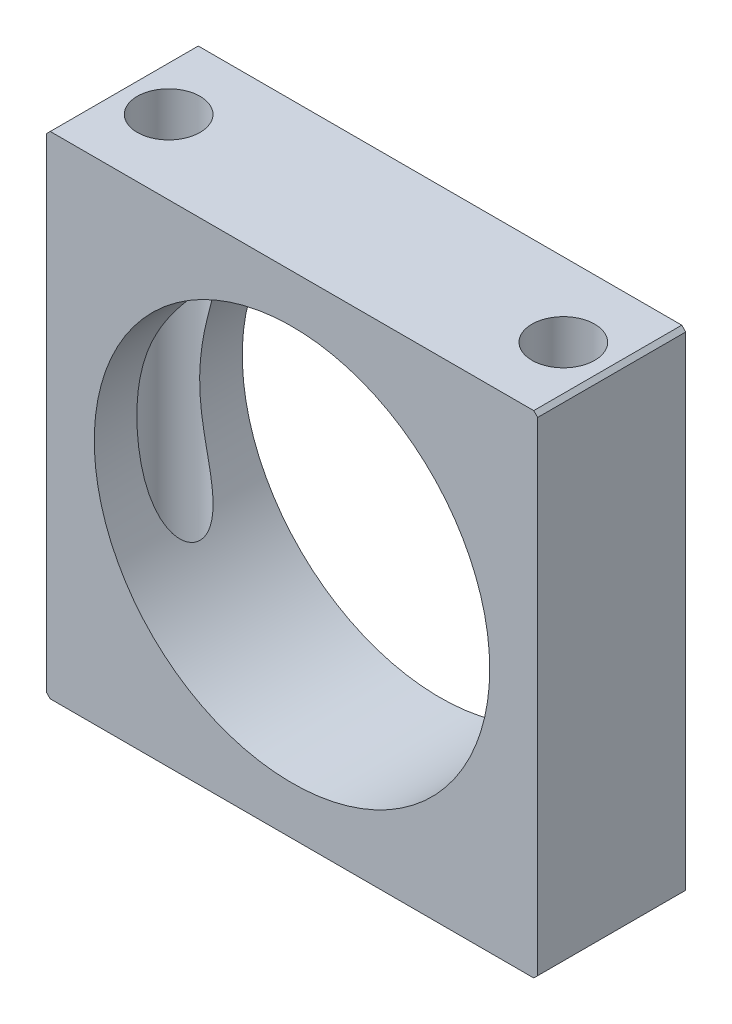
ISO-10303-21;
HEADER;
FILE_DESCRIPTION(('STEP AP214'),'2;1');
FILE_NAME('part.step','',(''),(''),'','','');
FILE_SCHEMA(('AUTOMOTIVE_DESIGN { 1 0 10303 214 1 1 1 1 }'));
ENDSEC;
DATA;
#1=APPLICATION_CONTEXT('core data for automotive mechanical design processes');
#2=APPLICATION_PROTOCOL_DEFINITION('international standard','automotive_design',2000,#1);
#3=PRODUCT_CONTEXT('',#1,'mechanical');
#4=PRODUCT('Part','Part','',(#3));
#5=PRODUCT_RELATED_PRODUCT_CATEGORY('part','',(#4));
#6=PRODUCT_DEFINITION_FORMATION('','',#4);
#7=PRODUCT_DEFINITION_CONTEXT('part definition',#1,'design');
#8=PRODUCT_DEFINITION('design','',#6,#7);
#9=PRODUCT_DEFINITION_SHAPE('','',#8);
#10=(LENGTH_UNIT() NAMED_UNIT(*) SI_UNIT(.MILLI.,.METRE.));
#11=(NAMED_UNIT(*) PLANE_ANGLE_UNIT() SI_UNIT($,.RADIAN.));
#12=(NAMED_UNIT(*) SI_UNIT($,.STERADIAN.) SOLID_ANGLE_UNIT());
#13=UNCERTAINTY_MEASURE_WITH_UNIT(LENGTH_MEASURE(1.E-05),#10,'distance_accuracy_value','');
#14=(GEOMETRIC_REPRESENTATION_CONTEXT(3) GLOBAL_UNCERTAINTY_ASSIGNED_CONTEXT((#13)) GLOBAL_UNIT_ASSIGNED_CONTEXT((#10,
#11,#12)) REPRESENTATION_CONTEXT('',''));
#15=CARTESIAN_POINT('',(0.,0.,0.));
#16=DIRECTION('',(0.,0.,1.));
#17=DIRECTION('',(1.,0.,0.));
#18=AXIS2_PLACEMENT_3D('',#15,#16,#17);
#19=CARTESIAN_POINT('',(0.,0.254000000000004,0.));
#20=DIRECTION('',(0.707106781186558,0.707106781186537,0.));
#21=DIRECTION('',(-0.707106781186537,0.707106781186558,0.));
#22=AXIS2_PLACEMENT_3D('',#19,#20,#21);
#23=PLANE('',#22);
#24=DIRECTION('',(0.,0.,1.));
#25=VECTOR('',#24,1.);
#26=CARTESIAN_POINT('',(0.253999999999997,0.,0.));
#27=LINE('',#26,#25);
#28=CARTESIAN_POINT('',(0.253999999999997,0.,9.525));
#29=VERTEX_POINT('',#28);
#30=CARTESIAN_POINT('',(0.253999999999997,0.,0.));
#31=VERTEX_POINT('',#30);
#32=EDGE_CURVE('E141',#29,#31,#27,.F.);
#33=ORIENTED_EDGE('',*,*,#32,.F.);
#34=DIRECTION('',(-0.707106781186537,0.707106781186558,0.));
#35=VECTOR('',#34,1.);
#36=CARTESIAN_POINT('',(0.,0.254000000000004,9.525));
#37=LINE('',#36,#35);
#38=CARTESIAN_POINT('',(0.,0.254000000000013,9.525));
#39=VERTEX_POINT('',#38);
#40=EDGE_CURVE('E99',#39,#29,#37,.F.);
#41=ORIENTED_EDGE('',*,*,#40,.F.);
#42=DIRECTION('',(0.,0.,1.));
#43=VECTOR('',#42,1.);
#44=CARTESIAN_POINT('',(0.,0.254000000000018,0.));
#45=LINE('',#44,#43);
#46=CARTESIAN_POINT('',(0.,0.254000000000013,0.));
#47=VERTEX_POINT('',#46);
#48=EDGE_CURVE('E98',#47,#39,#45,.T.);
#49=ORIENTED_EDGE('',*,*,#48,.F.);
#50=DIRECTION('',(0.707106781186527,-0.707106781186568,0.));
#51=VECTOR('',#50,1.);
#52=CARTESIAN_POINT('',(0.,0.254000000000015,0.));
#53=LINE('',#52,#51);
#54=EDGE_CURVE('E86',#47,#31,#53,.T.);
#55=ORIENTED_EDGE('',*,*,#54,.T.);
#56=EDGE_LOOP('',(#33,#41,#49,#55));
#57=FACE_BOUND('',#56,.T.);
#58=ADVANCED_FACE('F17',(#57),#23,.F.);
#59=CARTESIAN_POINT('',(31.369,0.,0.));
#60=DIRECTION('',(-0.707106781186547,0.707106781186548,0.));
#61=DIRECTION('',(-0.707106781186548,-0.707106781186547,0.));
#62=AXIS2_PLACEMENT_3D('',#59,#60,#61);
#63=PLANE('',#62);
#64=DIRECTION('',(0.,0.,-1.));
#65=VECTOR('',#64,1.);
#66=CARTESIAN_POINT('',(31.623,0.254000000000007,0.));
#67=LINE('',#66,#65);
#68=CARTESIAN_POINT('',(31.623,0.254000000000007,9.525));
#69=VERTEX_POINT('',#68);
#70=CARTESIAN_POINT('',(31.623,0.254000000000007,0.));
#71=VERTEX_POINT('',#70);
#72=EDGE_CURVE('E228',#69,#71,#67,.T.);
#73=ORIENTED_EDGE('',*,*,#72,.F.);
#74=DIRECTION('',(-0.707106781186548,-0.707106781186547,0.));
#75=VECTOR('',#74,1.);
#76=CARTESIAN_POINT('',(31.369,0.,9.525));
#77=LINE('',#76,#75);
#78=CARTESIAN_POINT('',(31.369,0.,9.525));
#79=VERTEX_POINT('',#78);
#80=EDGE_CURVE('E122',#79,#69,#77,.F.);
#81=ORIENTED_EDGE('',*,*,#80,.F.);
#82=DIRECTION('',(0.,0.,1.));
#83=VECTOR('',#82,1.);
#84=CARTESIAN_POINT('',(31.369,0.,0.));
#85=LINE('',#84,#83);
#86=CARTESIAN_POINT('',(31.369,0.,0.));
#87=VERTEX_POINT('',#86);
#88=EDGE_CURVE('E234',#87,#79,#85,.T.);
#89=ORIENTED_EDGE('',*,*,#88,.F.);
#90=DIRECTION('',(0.707106781186555,0.70710678118654,0.));
#91=VECTOR('',#90,1.);
#92=CARTESIAN_POINT('',(31.369,0.,0.));
#93=LINE('',#92,#91);
#94=EDGE_CURVE('E118',#87,#71,#93,.T.);
#95=ORIENTED_EDGE('',*,*,#94,.T.);
#96=EDGE_LOOP('',(#73,#81,#89,#95));
#97=FACE_BOUND('',#96,.T.);
#98=ADVANCED_FACE('F202',(#97),#63,.F.);
#99=CARTESIAN_POINT('',(28.5115,0.,4.7625));
#100=DIRECTION('',(0.,1.,0.));
#101=DIRECTION('',(0.,0.,1.));
#102=AXIS2_PLACEMENT_3D('',#99,#100,#101);
#103=CYLINDRICAL_SURFACE('',#102,2.0193);
#104=CARTESIAN_POINT('',(28.5115,0.,4.7625));
#105=DIRECTION('',(0.,1.,0.));
#106=DIRECTION('',(0.,0.,1.));
#107=AXIS2_PLACEMENT_3D('',#104,#105,#106);
#108=CIRCLE('',#107,2.0193);
#109=CARTESIAN_POINT('',(28.5115,0.,6.7818));
#110=VERTEX_POINT('',#109);
#111=EDGE_CURVE('E142',#110,#110,#108,.T.);
#112=ORIENTED_EDGE('',*,*,#111,.F.);
#113=EDGE_LOOP('',(#112));
#114=FACE_BOUND('',#113,.T.);
#115=CARTESIAN_POINT('',(28.5115,31.623,4.7625));
#116=DIRECTION('',(0.,1.,0.));
#117=DIRECTION('',(0.,0.,1.));
#118=AXIS2_PLACEMENT_3D('',#115,#116,#117);
#119=CIRCLE('',#118,2.0193);
#120=CARTESIAN_POINT('',(28.5115,31.623,6.7818));
#121=VERTEX_POINT('',#120);
#122=EDGE_CURVE('E134',#121,#121,#119,.F.);
#123=ORIENTED_EDGE('',*,*,#122,.F.);
#124=EDGE_LOOP('',(#123));
#125=FACE_BOUND('',#124,.T.);
#126=CARTESIAN_POINT('',(28.5115,16.6151200345937,2.74319999999999));
#127=CARTESIAN_POINT('',(28.5199653212104,16.4813430370531,2.74320270239754));
#128=CARTESIAN_POINT('',(28.5263158762675,16.3474399768635,2.74325062802151));
#129=CARTESIAN_POINT('',(28.5347827517717,16.0795244702182,2.74332907875549));
#130=CARTESIAN_POINT('',(28.5368999709793,15.945512053025,2.74335960755796));
#131=CARTESIAN_POINT('',(28.536900029006,15.6775559166359,2.74335990186155));
#132=CARTESIAN_POINT('',(28.5347850149188,15.5436121970708,2.7433296981734));
#133=CARTESIAN_POINT('',(28.526322201603,15.2756951322222,2.74325009105277));
#134=CARTESIAN_POINT('',(28.5199692103383,15.141721952357,2.74320066410047));
#135=CARTESIAN_POINT('',(28.5006511685445,14.836431967293,2.74319914930508));
#136=CARTESIAN_POINT('',(28.4863298494317,14.6651992426276,2.74327831319996));
#137=CARTESIAN_POINT('',(28.4507639873802,14.3234367237259,2.74403545692543));
#138=CARTESIAN_POINT('',(28.4295186182925,14.1529070158304,2.74471350822932));
#139=CARTESIAN_POINT('',(28.3801081029875,13.8126273188276,2.74732705653674));
#140=CARTESIAN_POINT('',(28.3519337391881,13.6428786777253,2.74926423423161));
#141=CARTESIAN_POINT('',(28.2887344511936,13.3047070137621,2.75527405754353));
#142=CARTESIAN_POINT('',(28.2537099752288,13.136283904916,2.75934656346674));
#143=CARTESIAN_POINT('',(28.1769646117507,12.8014278569892,2.77072658272209));
#144=CARTESIAN_POINT('',(28.1352572434751,12.6349916138971,2.77802761625686));
#145=CARTESIAN_POINT('',(28.0452092323457,12.3041426687441,2.7972347694156));
#146=CARTESIAN_POINT('',(27.9968673350173,12.1397303557952,2.80914176072264));
#147=CARTESIAN_POINT('',(27.8938736743695,11.8138519914117,2.83922573844674));
#148=CARTESIAN_POINT('',(27.8392357894094,11.6523803350742,2.85738910332814));
#149=CARTESIAN_POINT('',(27.7239329906724,11.3328225229877,2.90208533464119));
#150=CARTESIAN_POINT('',(27.6632714901554,11.1747345109502,2.92861347953247));
#151=CARTESIAN_POINT('',(27.5611040048811,10.9234282453846,2.98030993829984));
#152=CARTESIAN_POINT('',(27.5212840116499,10.8288109678863,3.00202178517003));
#153=CARTESIAN_POINT('',(27.4398400254016,10.6415939416869,3.050377247796));
#154=CARTESIAN_POINT('',(27.3982156979782,10.5489945717947,3.07702178076999));
#155=CARTESIAN_POINT('',(27.3135925758823,10.3665242495133,3.13607804401843));
#156=CARTESIAN_POINT('',(27.2705968024584,10.2766480494975,3.16847773059296));
#157=CARTESIAN_POINT('',(27.1836682807955,10.1001723616852,3.24013158612093));
#158=CARTESIAN_POINT('',(27.1397360141316,10.0135712503972,3.27938230329852));
#159=CARTESIAN_POINT('',(27.0428235727008,9.82766971518366,3.37466896265823));
#160=CARTESIAN_POINT('',(26.9897907548617,9.72929256687629,3.43249187626515));
#161=CARTESIAN_POINT('',(26.8854037535374,9.54125584218823,3.56236770191023));
#162=CARTESIAN_POINT('',(26.8340480633198,9.45158828961998,3.63440740742342));
#163=CARTESIAN_POINT('',(26.7500560588286,9.30852636786551,3.77281480481567));
#164=CARTESIAN_POINT('',(26.7161946798853,9.25199167963295,3.83515712711531));
#165=CARTESIAN_POINT('',(26.6530714006376,9.14818213783625,3.96922714840786));
#166=CARTESIAN_POINT('',(26.6238016963597,9.10089153867167,4.04093853501115));
#167=CARTESIAN_POINT('',(26.5782901191154,9.02817900877144,4.17589592751221));
#168=CARTESIAN_POINT('',(26.5606005197941,9.00022890095212,4.23727886934799));
#169=CARTESIAN_POINT('',(26.530700673956,8.9532698465948,4.36466399569805));
#170=CARTESIAN_POINT('',(26.5184864081335,8.93425434089277,4.43066275058029));
#171=CARTESIAN_POINT('',(26.5005967821325,8.90648006472163,4.56618929204118));
#172=CARTESIAN_POINT('',(26.4949681743239,8.89779462150321,4.63573869579954));
#173=CARTESIAN_POINT('',(26.4910334801698,8.89171771459723,4.77553213975767));
#174=CARTESIAN_POINT('',(26.4927247769399,8.89432221472707,4.84577592275619));
#175=CARTESIAN_POINT('',(26.502651666022,8.90967819577877,4.97686824520258));
#176=CARTESIAN_POINT('',(26.5101595332167,8.92130154238223,5.03791113034199));
#177=CARTESIAN_POINT('',(26.530196103875,8.95251309430616,5.15703949635868));
#178=CARTESIAN_POINT('',(26.5427265405966,8.97210404923387,5.21512394849178));
#179=CARTESIAN_POINT('',(26.57694270403,9.0260469027609,5.34654892578309));
#180=CARTESIAN_POINT('',(26.6002937427548,9.06315517287232,5.4183210162055));
#181=CARTESIAN_POINT('',(26.6522961811466,9.1470128956751,5.55384791767831));
#182=CARTESIAN_POINT('',(26.6809581643453,9.19378162124462,5.61758628550761));
#183=CARTESIAN_POINT('',(26.7567395024462,9.3195659189768,5.76671740611479));
#184=CARTESIAN_POINT('',(26.8059710354522,9.4030823048063,5.84720607711694));
#185=CARTESIAN_POINT('',(26.9076837203132,9.58084362320606,5.99264253749174));
#186=CARTESIAN_POINT('',(26.9601715653595,9.67511101114221,6.05755688646532));
#187=CARTESIAN_POINT('',(27.0598160898548,9.85994815666871,6.16786700297967));
#188=CARTESIAN_POINT('',(27.1069116055799,9.94974997418169,6.21463444727179));
#189=CARTESIAN_POINT('',(27.2004730258325,10.1336696801777,6.29963354602526));
#190=CARTESIAN_POINT('',(27.2469383894366,10.2277910059898,6.33785825533661));
#191=CARTESIAN_POINT('',(27.3385654476197,10.4194794845627,6.40721975903296));
#192=CARTESIAN_POINT('',(27.3837239184833,10.5170540240365,6.4383401472906));
#193=CARTESIAN_POINT('',(27.4721306897576,10.7147147019151,6.49455815108557));
#194=CARTESIAN_POINT('',(27.515379455027,10.8148002196941,6.51965723898987));
#195=CARTESIAN_POINT('',(27.6012065605999,11.020725490405,6.56566280556071));
#196=CARTESIAN_POINT('',(27.6437016974488,11.1266414750135,6.58638106462946));
#197=CARTESIAN_POINT('',(27.7260715508051,11.3402686968131,6.62333483550237));
#198=CARTESIAN_POINT('',(27.7659456990083,11.4479803170433,6.63956937753766));
#199=CARTESIAN_POINT('',(27.8814369784417,11.7735029371737,6.68275843258262));
#200=CARTESIAN_POINT('',(27.9528606496037,11.9935525731978,6.704167592949));
#201=CARTESIAN_POINT('',(28.0837726819043,12.4379435300594,6.73712794314051));
#202=CARTESIAN_POINT('',(28.1432536681567,12.6622874096153,6.74867305592211));
#203=CARTESIAN_POINT('',(28.2498686036745,13.1139815977602,6.76550530758962));
#204=CARTESIAN_POINT('',(28.2970089588245,13.3413302819456,6.77079569826742));
#205=CARTESIAN_POINT('',(28.3804709444385,13.8077062009253,6.77799711241717));
#206=CARTESIAN_POINT('',(28.4162676544204,14.0468290783341,6.77976014095217));
#207=CARTESIAN_POINT('',(28.4741517207061,14.5264596465523,6.7816630688818));
#208=CARTESIAN_POINT('',(28.4962550825482,14.7669653877115,6.78180486665852));
#209=CARTESIAN_POINT('',(28.5199653212104,15.1416569629469,6.78179729760245));
#210=CARTESIAN_POINT('',(28.5263158762675,15.2755600231365,6.78174937197848));
#211=CARTESIAN_POINT('',(28.5347827517717,15.5434755297818,6.7816709212445));
#212=CARTESIAN_POINT('',(28.5368999709793,15.677487946975,6.78164039244203));
#213=CARTESIAN_POINT('',(28.536900029006,15.9454440833641,6.78164009813845));
#214=CARTESIAN_POINT('',(28.5347850149188,16.0793878029292,6.7816703018266));
#215=CARTESIAN_POINT('',(28.526322201603,16.3473048677777,6.78174990894722));
#216=CARTESIAN_POINT('',(28.5199692103383,16.481278047643,6.78179933589952));
#217=CARTESIAN_POINT('',(28.5006511685445,16.786568032707,6.78180085069491));
#218=CARTESIAN_POINT('',(28.4863298494317,16.9578007573724,6.78172168680003));
#219=CARTESIAN_POINT('',(28.4507639873802,17.2995632762741,6.78096454307456));
#220=CARTESIAN_POINT('',(28.4295186182925,17.4700929841696,6.78028649177068));
#221=CARTESIAN_POINT('',(28.3801081029875,17.8103726811724,6.77767294346325));
#222=CARTESIAN_POINT('',(28.3519337391881,17.9801213222747,6.77573576576838));
#223=CARTESIAN_POINT('',(28.2887344511936,18.3182929862379,6.76972594245647));
#224=CARTESIAN_POINT('',(28.2537099752288,18.486716095084,6.76565343653326));
#225=CARTESIAN_POINT('',(28.1769646117507,18.8215721430108,6.75427341727791));
#226=CARTESIAN_POINT('',(28.1352572434751,18.9880083861029,6.74697238374313));
#227=CARTESIAN_POINT('',(28.0452092323457,19.3188573312559,6.7277652305844));
#228=CARTESIAN_POINT('',(27.9968673350173,19.4832696442048,6.71585823927735));
#229=CARTESIAN_POINT('',(27.8938736743695,19.8091480085883,6.68577426155325));
#230=CARTESIAN_POINT('',(27.8392357894094,19.9706196649258,6.66761089667185));
#231=CARTESIAN_POINT('',(27.7239329906724,20.2901774770123,6.6229146653588));
#232=CARTESIAN_POINT('',(27.6632714901554,20.4482654890498,6.59638652046752));
#233=CARTESIAN_POINT('',(27.5611040048811,20.6995717546154,6.54469006170015));
#234=CARTESIAN_POINT('',(27.5212840116499,20.7941890321136,6.52297821482996));
#235=CARTESIAN_POINT('',(27.4398400254016,20.9814060583131,6.47462275220399));
#236=CARTESIAN_POINT('',(27.3982156979782,21.0740054282053,6.44797821923));
#237=CARTESIAN_POINT('',(27.3135925758823,21.2564757504867,6.38892195598156));
#238=CARTESIAN_POINT('',(27.2705968024584,21.3463519505025,6.35652226940703));
#239=CARTESIAN_POINT('',(27.1836682807954,21.5228276383148,6.28486841387906));
#240=CARTESIAN_POINT('',(27.1397360141316,21.6094287496028,6.24561769670148));
#241=CARTESIAN_POINT('',(27.0428235727008,21.7953302848163,6.15033103734176));
#242=CARTESIAN_POINT('',(26.9897907548617,21.8937074331237,6.09250812373485));
#243=CARTESIAN_POINT('',(26.8854037535374,22.0817441578118,5.96263229808976));
#244=CARTESIAN_POINT('',(26.8340480633198,22.17141171038,5.89059259257657));
#245=CARTESIAN_POINT('',(26.7500560588286,22.3144736321345,5.75218519518432));
#246=CARTESIAN_POINT('',(26.7161946798853,22.371008320367,5.68984287288469));
#247=CARTESIAN_POINT('',(26.6530714006376,22.4748178621637,5.55577285159213));
#248=CARTESIAN_POINT('',(26.6238016963597,22.5221084613283,5.48406146498885));
#249=CARTESIAN_POINT('',(26.5782901191154,22.5948209912286,5.34910407248778));
#250=CARTESIAN_POINT('',(26.5606005197941,22.6227710990479,5.28772113065201));
#251=CARTESIAN_POINT('',(26.530700673956,22.6697301534052,5.16033600430194));
#252=CARTESIAN_POINT('',(26.5184864081335,22.6887456591072,5.0943372494197));
#253=CARTESIAN_POINT('',(26.5005967821325,22.7165199352784,4.95881070795881));
#254=CARTESIAN_POINT('',(26.4949681743239,22.7252053784968,4.88926130420045));
#255=CARTESIAN_POINT('',(26.4910334801698,22.7312822854028,4.74946786024232));
#256=CARTESIAN_POINT('',(26.4927247769399,22.7286777852729,4.6792240772438));
#257=CARTESIAN_POINT('',(26.502651666022,22.7133218042212,4.54813175479741));
#258=CARTESIAN_POINT('',(26.5101595332167,22.7016984576178,4.487088869658));
#259=CARTESIAN_POINT('',(26.530196103875,22.6704869056938,4.36796050364131));
#260=CARTESIAN_POINT('',(26.5427265405966,22.6508959507661,4.30987605150821));
#261=CARTESIAN_POINT('',(26.57694270403,22.5969530972391,4.1784510742169));
#262=CARTESIAN_POINT('',(26.6002937427548,22.5598448271277,4.10667898379449));
#263=CARTESIAN_POINT('',(26.6522961811466,22.4759871043249,3.97115208232168));
#264=CARTESIAN_POINT('',(26.6809581643453,22.4292183787554,3.90741371449238));
#265=CARTESIAN_POINT('',(26.7567395024462,22.3034340810232,3.7582825938852));
#266=CARTESIAN_POINT('',(26.8059710354522,22.2199176951937,3.67779392288305));
#267=CARTESIAN_POINT('',(26.9076837203132,22.0421563767939,3.53235746250825));
#268=CARTESIAN_POINT('',(26.9601715653595,21.9478889888578,3.46744311353467));
#269=CARTESIAN_POINT('',(27.0598160898548,21.7630518433313,3.35713299702032));
#270=CARTESIAN_POINT('',(27.1069116055799,21.6732500258183,3.3103655527282));
#271=CARTESIAN_POINT('',(27.2004730258325,21.4893303198223,3.22536645397473));
#272=CARTESIAN_POINT('',(27.2469383894366,21.3952089940102,3.18714174466338));
#273=CARTESIAN_POINT('',(27.3385654476197,21.2035205154373,3.11778024096703));
#274=CARTESIAN_POINT('',(27.3837239184833,21.1059459759635,3.08665985270939));
#275=CARTESIAN_POINT('',(27.4721306897576,20.9082852980849,3.03044184891442));
#276=CARTESIAN_POINT('',(27.515379455027,20.8081997803059,3.00534276101012));
#277=CARTESIAN_POINT('',(27.6012065605999,20.602274509595,2.95933719443928));
#278=CARTESIAN_POINT('',(27.6437016974488,20.4963585249865,2.93861893537053));
#279=CARTESIAN_POINT('',(27.7260715508051,20.2827313031868,2.90166516449762));
#280=CARTESIAN_POINT('',(27.7659456990083,20.1750196829567,2.88543062246233));
#281=CARTESIAN_POINT('',(27.8814369784417,19.8494970628263,2.84224156741738));
#282=CARTESIAN_POINT('',(27.9528606496037,19.6294474268022,2.82083240705099));
#283=CARTESIAN_POINT('',(28.0837726819043,19.1850564699406,2.78787205685948));
#284=CARTESIAN_POINT('',(28.1432536681567,18.9607125903847,2.77632694407788));
#285=CARTESIAN_POINT('',(28.2498686036745,18.5090184022398,2.75949469241037));
#286=CARTESIAN_POINT('',(28.2970089588245,18.2816697180544,2.75420430173257));
#287=CARTESIAN_POINT('',(28.3804709444385,17.8152937990747,2.74700288758283));
#288=CARTESIAN_POINT('',(28.4162676544204,17.5761709216659,2.74523985904783));
#289=CARTESIAN_POINT('',(28.4741517207061,17.0965403534477,2.74333693111819));
#290=CARTESIAN_POINT('',(28.4962550825482,16.8560346122885,2.74319513334148));
#291=CARTESIAN_POINT('',(28.5115,16.6151200345937,2.74319999999999));
#292=B_SPLINE_CURVE_WITH_KNOTS('',3,(#126,#127,#128,#129,#130,#131,#132,#133,#134,#135,#136,
#137,#138,#139,#140,#141,#142,#143,#144,#145,#146,#147,#148,#149,#150,#151,#152,#153,#154,#155,
#156,#157,#158,#159,#160,#161,#162,#163,#164,#165,#166,#167,#168,#169,#170,#171,#172,#173,#174,
#175,#176,#177,#178,#179,#180,#181,#182,#183,#184,#185,#186,#187,#188,#189,#190,#191,#192,#193,
#194,#195,#196,#197,#198,#199,#200,#201,#202,#203,#204,#205,#206,#207,#208,#209,#210,#211,#212,
#213,#214,#215,#216,#217,#218,#219,#220,#221,#222,#223,#224,#225,#226,#227,#228,#229,#230,#231,
#232,#233,#234,#235,#236,#237,#238,#239,#240,#241,#242,#243,#244,#245,#246,#247,#248,#249,#250,
#251,#252,#253,#254,#255,#256,#257,#258,#259,#260,#261,#262,#263,#264,#265,#266,#267,#268,#269,
#270,#271,#272,#273,#274,#275,#276,#277,#278,#279,#280,#281,#282,#283,#284,#285,#286,#287,#288,
#289,#290,#291),.UNSPECIFIED.,.T.,.F.,(4,2,2,2,2,2,2,2,2,2,2,2,2,2,2,2,2,2,2,2,2,2,2,2,2,2,2,2,
2,2,2,2,2,2,2,2,2,2,2,2,2,2,2,2,2,2,2,2,2,2,2,2,2,2,2,2,2,2,2,2,2,2,2,2,2,2,2,2,2,2,2,2,2,2,2,2,
2,2,2,2,2,2,4),(0.,0.40210354142174,0.804121705000044,1.20593596872273,1.6082434099645,
2.12358845973877,2.63899502087777,3.15509096730215,3.67115315477977,4.18618425078339,
4.70131286476891,5.21532694358039,5.72905140248845,6.04370670327851,6.35842057215425,
6.67248344208353,6.98638853111204,7.36306166959052,7.73938653512679,8.01071437980907,
8.28157596150202,8.4899567200692,8.69818426001524,8.90788123152498,9.11750324203387,
9.30444924962508,9.49145982676311,9.74236854129282,9.99378274603126,10.3696803912375,
10.7463780630539,11.0808945812981,11.4156820764171,11.7512350524477,12.0867058930888,
12.4345188051393,12.7824068857297,13.4786748948486,14.1753715521646,14.8717058416363,
15.5966898402826,16.3208248309917,16.7229283724135,17.1249465359918,17.5267607997144,
17.9290682409562,18.4444132907305,18.9598198518695,19.4759157982939,19.9919779857715,
20.5070090817751,21.0221376957606,21.5361517745721,22.0498762334802,22.3645315342702,
22.679245403146,22.9933082730753,23.3072133621038,23.6838865005822,24.0602113661185,
24.3315392108008,24.6024007924937,24.8107815510609,25.019009091007,25.2287060625167,
25.4383280730256,25.6252740806168,25.8122846577548,26.0631933722846,26.314607577023,
26.6905052222292,27.0672028940456,27.4017194122898,27.7365069074088,28.0720598834394,
28.4075307240805,28.7553436361311,29.1032317167214,29.7994997258403,30.4961963831563,
31.1925306726281,31.9175146712743,32.6416496619835),.UNSPECIFIED.);
#293=CARTESIAN_POINT('',(28.5115,16.6151200345937,2.74319999999999));
#294=VERTEX_POINT('',#293);
#295=EDGE_CURVE('E20',#294,#294,#292,.T.);
#296=ORIENTED_EDGE('',*,*,#295,.T.);
#297=EDGE_LOOP('',(#296));
#298=FACE_BOUND('',#297,.T.);
#299=ADVANCED_FACE('F170',(#114,#125,#298),#103,.F.);
#300=CARTESIAN_POINT('',(3.1115,0.,4.7625));
#301=DIRECTION('',(0.,1.,0.));
#302=DIRECTION('',(0.,0.,1.));
#303=AXIS2_PLACEMENT_3D('',#300,#301,#302);
#304=CYLINDRICAL_SURFACE('',#303,2.0193);
#305=CARTESIAN_POINT('',(3.1115,16.6151200345936,6.7818));
#306=CARTESIAN_POINT('',(3.10303467878958,16.481343037053,6.78179729760245));
#307=CARTESIAN_POINT('',(3.09668412373254,16.3474399768634,6.78174937197848));
#308=CARTESIAN_POINT('',(3.08821724822826,16.0795244702181,6.7816709212445));
#309=CARTESIAN_POINT('',(3.08610002902073,15.945512053025,6.78164039244204));
#310=CARTESIAN_POINT('',(3.08609997099397,15.677555916636,6.78164009813845));
#311=CARTESIAN_POINT('',(3.08821498508121,15.5436121970708,6.7816703018266));
#312=CARTESIAN_POINT('',(3.09667779839696,15.2756951322223,6.78174990894723));
#313=CARTESIAN_POINT('',(3.10303078966174,15.1417219523571,6.78179933589952));
#314=CARTESIAN_POINT('',(3.12234883145549,14.8364319672931,6.78180085069491));
#315=CARTESIAN_POINT('',(3.13667015056824,14.6651992426277,6.78172168680004));
#316=CARTESIAN_POINT('',(3.17223601261975,14.323436723726,6.78096454307456));
#317=CARTESIAN_POINT('',(3.1934813817075,14.1529070158306,6.78028649177068));
#318=CARTESIAN_POINT('',(3.24289189701244,13.8126273188277,6.77767294346325));
#319=CARTESIAN_POINT('',(3.27106626081184,13.6428786777255,6.77573576576838));
#320=CARTESIAN_POINT('',(3.33426554880642,13.3047070137623,6.76972594245647));
#321=CARTESIAN_POINT('',(3.36929002477115,13.1362839049161,6.76565343653326));
#322=CARTESIAN_POINT('',(3.44603538824928,12.8014278569893,6.75427341727791));
#323=CARTESIAN_POINT('',(3.48774275652484,12.6349916138972,6.74697238374314));
#324=CARTESIAN_POINT('',(3.57779076765423,12.3041426687442,6.7277652305844));
#325=CARTESIAN_POINT('',(3.6261326649827,12.1397303557953,6.71585823927736));
#326=CARTESIAN_POINT('',(3.72912632563049,11.8138519914118,6.68577426155326));
#327=CARTESIAN_POINT('',(3.78376421059059,11.6523803350743,6.66761089667187));
#328=CARTESIAN_POINT('',(3.89906700932753,11.3328225229879,6.62291466535881));
#329=CARTESIAN_POINT('',(3.95972850984452,11.1747345109503,6.59638652046754));
#330=CARTESIAN_POINT('',(4.0618959951189,10.9234282453847,6.54469006170017));
#331=CARTESIAN_POINT('',(4.1017159883501,10.8288109678864,6.52297821482998));
#332=CARTESIAN_POINT('',(4.18315997459838,10.6415939416869,6.47462275220401));
#333=CARTESIAN_POINT('',(4.22478430202177,10.5489945717947,6.44797821923002));
#334=CARTESIAN_POINT('',(4.30940742411767,10.3665242495133,6.38892195598158));
#335=CARTESIAN_POINT('',(4.35240319754159,10.2766480494976,6.35652226940705));
#336=CARTESIAN_POINT('',(4.43933171920453,10.1001723616853,6.28486841387908));
#337=CARTESIAN_POINT('',(4.48326398586839,10.0135712503973,6.24561769670149));
#338=CARTESIAN_POINT('',(4.58017642729918,9.82766971518369,6.15033103734177));
#339=CARTESIAN_POINT('',(4.6332092451383,9.72929256687632,6.09250812373486));
#340=CARTESIAN_POINT('',(4.7375962464626,9.54125584218826,5.96263229808978));
#341=CARTESIAN_POINT('',(4.78895193668016,9.45158828962002,5.89059259257659));
#342=CARTESIAN_POINT('',(4.87294394117134,9.30852636786555,5.75218519518435));
#343=CARTESIAN_POINT('',(4.90680532011464,9.25199167963299,5.68984287288471));
#344=CARTESIAN_POINT('',(4.96992859936243,9.14818213783628,5.55577285159216));
#345=CARTESIAN_POINT('',(4.99919830364024,9.1008915386717,5.48406146498887));
#346=CARTESIAN_POINT('',(5.04470988088462,9.02817900877146,5.3491040724878));
#347=CARTESIAN_POINT('',(5.06239948020592,9.00022890095214,5.28772113065203));
#348=CARTESIAN_POINT('',(5.09229932604396,8.95326984659481,5.16033600430196));
#349=CARTESIAN_POINT('',(5.10451359186649,8.93425434089279,5.09433724941972));
#350=CARTESIAN_POINT('',(5.12240321786751,8.90648006472165,4.95881070795883));
#351=CARTESIAN_POINT('',(5.12803182567607,8.89779462150323,4.88926130420047));
#352=CARTESIAN_POINT('',(5.13196651983023,8.89171771459725,4.74946786024234));
#353=CARTESIAN_POINT('',(5.13027522306011,8.89432221472708,4.67922407724382));
#354=CARTESIAN_POINT('',(5.12034833397796,8.90967819577878,4.54813175479743));
#355=CARTESIAN_POINT('',(5.11284046678328,8.92130154238224,4.48708886965802));
#356=CARTESIAN_POINT('',(5.09280389612503,8.95251309430617,4.36796050364133));
#357=CARTESIAN_POINT('',(5.08027345940335,8.97210404923388,4.30987605150823));
#358=CARTESIAN_POINT('',(5.04605729597002,9.02604690276091,4.17845107421692));
#359=CARTESIAN_POINT('',(5.02270625724518,9.06315517287233,4.10667898379451));
#360=CARTESIAN_POINT('',(4.97070381885335,9.1470128956751,3.9711520823217));
#361=CARTESIAN_POINT('',(4.94204183565467,9.19378162124462,3.9074137144924));
#362=CARTESIAN_POINT('',(4.86626049755376,9.3195659189768,3.75828259388523));
#363=CARTESIAN_POINT('',(4.81702896454783,9.4030823048063,3.67779392288308));
#364=CARTESIAN_POINT('',(4.71531627968681,9.58084362320606,3.53235746250828));
#365=CARTESIAN_POINT('',(4.66282843464055,9.6751110111422,3.4674431135347));
#366=CARTESIAN_POINT('',(4.56318391014516,9.8599481566687,3.35713299702035));
#367=CARTESIAN_POINT('',(4.5160883944201,9.94974997418167,3.31036555272823));
#368=CARTESIAN_POINT('',(4.42252697416751,10.1336696801777,3.22536645397475));
#369=CARTESIAN_POINT('',(4.37606161056346,10.2277910059898,3.1871417446634));
#370=CARTESIAN_POINT('',(4.28443455238028,10.4194794845627,3.11778024096705));
#371=CARTESIAN_POINT('',(4.23927608151668,10.5170540240364,3.08665985270942));
#372=CARTESIAN_POINT('',(4.15086931024237,10.7147147019151,3.03044184891444));
#373=CARTESIAN_POINT('',(4.10762054497305,10.8148002196941,3.00534276101014));
#374=CARTESIAN_POINT('',(4.02179343940012,11.020725490405,2.9593371944393));
#375=CARTESIAN_POINT('',(3.97929830255117,11.1266414750134,2.93861893537055));
#376=CARTESIAN_POINT('',(3.89692844919489,11.3402686968131,2.90166516449764));
#377=CARTESIAN_POINT('',(3.85705430099169,11.4479803170432,2.88543062246235));
#378=CARTESIAN_POINT('',(3.74156302155836,11.7735029371737,2.84224156741739));
#379=CARTESIAN_POINT('',(3.67013935039628,11.9935525731977,2.820832407051));
#380=CARTESIAN_POINT('',(3.53922731809574,12.4379435300593,2.78787205685949));
#381=CARTESIAN_POINT('',(3.47974633184333,12.6622874096152,2.77632694407789));
#382=CARTESIAN_POINT('',(3.37313139632555,13.1139815977601,2.75949469241038));
#383=CARTESIAN_POINT('',(3.32599104117548,13.3413302819455,2.75420430173258));
#384=CARTESIAN_POINT('',(3.2425290555615,13.8077062009252,2.74700288758283));
#385=CARTESIAN_POINT('',(3.20673234557958,14.046829078334,2.74523985904783));
#386=CARTESIAN_POINT('',(3.14884827929394,14.5264596465523,2.7433369311182));
#387=CARTESIAN_POINT('',(3.12674491745181,14.7669653877116,2.74319513334148));
#388=CARTESIAN_POINT('',(3.10303467878959,15.141656962947,2.74320270239755));
#389=CARTESIAN_POINT('',(3.09668412373254,15.2755600231366,2.74325062802152));
#390=CARTESIAN_POINT('',(3.08821724822826,15.5434755297819,2.7433290787555));
#391=CARTESIAN_POINT('',(3.08610002902073,15.677487946975,2.74335960755796));
#392=CARTESIAN_POINT('',(3.08609997099397,15.945444083364,2.74335990186155));
#393=CARTESIAN_POINT('',(3.08821498508121,16.0793878029292,2.7433296981734));
#394=CARTESIAN_POINT('',(3.09667779839696,16.3473048677777,2.74325009105277));
#395=CARTESIAN_POINT('',(3.10303078966174,16.4812780476429,2.74320066410048));
#396=CARTESIAN_POINT('',(3.12234883145549,16.7865680327069,2.74319914930509));
#397=CARTESIAN_POINT('',(3.13667015056824,16.9578007573723,2.74327831319997));
#398=CARTESIAN_POINT('',(3.17223601261975,17.299563276274,2.74403545692544));
#399=CARTESIAN_POINT('',(3.1934813817075,17.4700929841694,2.74471350822932));
#400=CARTESIAN_POINT('',(3.24289189701244,17.8103726811723,2.74732705653675));
#401=CARTESIAN_POINT('',(3.27106626081184,17.9801213222745,2.74926423423162));
#402=CARTESIAN_POINT('',(3.33426554880642,18.3182929862377,2.75527405754353));
#403=CARTESIAN_POINT('',(3.36929002477116,18.4867160950839,2.75934656346674));
#404=CARTESIAN_POINT('',(3.44603538824928,18.8215721430107,2.77072658272209));
#405=CARTESIAN_POINT('',(3.48774275652484,18.9880083861028,2.77802761625686));
#406=CARTESIAN_POINT('',(3.57779076765423,19.3188573312558,2.7972347694156));
#407=CARTESIAN_POINT('',(3.6261326649827,19.4832696442047,2.80914176072264));
#408=CARTESIAN_POINT('',(3.72912632563049,19.8091480085882,2.83922573844674));
#409=CARTESIAN_POINT('',(3.78376421059059,19.9706196649257,2.85738910332813));
#410=CARTESIAN_POINT('',(3.89906700932753,20.2901774770121,2.90208533464118));
#411=CARTESIAN_POINT('',(3.95972850984451,20.4482654890497,2.92861347953246));
#412=CARTESIAN_POINT('',(4.06189599511889,20.6995717546153,2.98030993829983));
#413=CARTESIAN_POINT('',(4.1017159883501,20.7941890321135,3.00202178517002));
#414=CARTESIAN_POINT('',(4.18315997459838,20.9814060583131,3.05037724779599));
#415=CARTESIAN_POINT('',(4.22478430202177,21.0740054282053,3.07702178076998));
#416=CARTESIAN_POINT('',(4.30940742411767,21.2564757504867,3.13607804401842));
#417=CARTESIAN_POINT('',(4.35240319754159,21.3463519505024,3.16847773059295));
#418=CARTESIAN_POINT('',(4.43933171920453,21.5228276383147,3.24013158612092));
#419=CARTESIAN_POINT('',(4.48326398586839,21.6094287496027,3.27938230329851));
#420=CARTESIAN_POINT('',(4.58017642729917,21.7953302848163,3.37466896265823));
#421=CARTESIAN_POINT('',(4.6332092451383,21.8937074331237,3.43249187626514));
#422=CARTESIAN_POINT('',(4.7375962464626,22.0817441578117,3.56236770191022));
#423=CARTESIAN_POINT('',(4.78895193668016,22.17141171038,3.63440740742341));
#424=CARTESIAN_POINT('',(4.87294394117134,22.3144736321345,3.77281480481565));
#425=CARTESIAN_POINT('',(4.90680532011464,22.371008320367,3.83515712711529));
#426=CARTESIAN_POINT('',(4.96992859936243,22.4748178621637,3.96922714840784));
#427=CARTESIAN_POINT('',(4.99919830364024,22.5221084613283,4.04093853501113));
#428=CARTESIAN_POINT('',(5.04470988088462,22.5948209912285,4.1758959275122));
#429=CARTESIAN_POINT('',(5.06239948020592,22.6227710990479,4.23727886934797));
#430=CARTESIAN_POINT('',(5.09229932604396,22.6697301534052,4.36466399569803));
#431=CARTESIAN_POINT('',(5.10451359186649,22.6887456591072,4.43066275058027));
#432=CARTESIAN_POINT('',(5.12240321786751,22.7165199352784,4.56618929204116));
#433=CARTESIAN_POINT('',(5.12803182567607,22.7252053784968,4.63573869579952));
#434=CARTESIAN_POINT('',(5.13196651983022,22.7312822854027,4.77553213975766));
#435=CARTESIAN_POINT('',(5.13027522306011,22.7286777852729,4.84577592275618));
#436=CARTESIAN_POINT('',(5.12034833397796,22.7133218042212,4.97686824520257));
#437=CARTESIAN_POINT('',(5.11284046678328,22.7016984576178,5.03791113034198));
#438=CARTESIAN_POINT('',(5.09280389612503,22.6704869056938,5.15703949635867));
#439=CARTESIAN_POINT('',(5.08027345940335,22.6508959507661,5.21512394849176));
#440=CARTESIAN_POINT('',(5.04605729597002,22.5969530972391,5.34654892578307));
#441=CARTESIAN_POINT('',(5.02270625724518,22.5598448271277,5.41832101620549));
#442=CARTESIAN_POINT('',(4.97070381885335,22.4759871043249,5.55384791767829));
#443=CARTESIAN_POINT('',(4.94204183565467,22.4292183787554,5.61758628550759));
#444=CARTESIAN_POINT('',(4.86626049755376,22.3034340810232,5.76671740611477));
#445=CARTESIAN_POINT('',(4.81702896454783,22.2199176951937,5.84720607711692));
#446=CARTESIAN_POINT('',(4.71531627968682,22.042156376794,5.99264253749171));
#447=CARTESIAN_POINT('',(4.66282843464056,21.9478889888578,6.05755688646529));
#448=CARTESIAN_POINT('',(4.56318391014517,21.7630518433313,6.16786700297965));
#449=CARTESIAN_POINT('',(4.5160883944201,21.6732500258183,6.21463444727176));
#450=CARTESIAN_POINT('',(4.42252697416752,21.4893303198223,6.29963354602524));
#451=CARTESIAN_POINT('',(4.37606161056347,21.3952089940102,6.33785825533659));
#452=CARTESIAN_POINT('',(4.28443455238029,21.2035205154373,6.40721975903294));
#453=CARTESIAN_POINT('',(4.23927608151669,21.1059459759636,6.43834014729058));
#454=CARTESIAN_POINT('',(4.15086931024238,20.9082852980849,6.49455815108555));
#455=CARTESIAN_POINT('',(4.10762054497306,20.8081997803059,6.51965723898986));
#456=CARTESIAN_POINT('',(4.02179343940013,20.6022745095951,6.5656628055607));
#457=CARTESIAN_POINT('',(3.97929830255118,20.4963585249866,6.58638106462944));
#458=CARTESIAN_POINT('',(3.8969284491949,20.2827313031869,6.62333483550236));
#459=CARTESIAN_POINT('',(3.85705430099171,20.1750196829568,6.63956937753765));
#460=CARTESIAN_POINT('',(3.74156302155837,19.8494970628264,6.68275843258261));
#461=CARTESIAN_POINT('',(3.67013935039629,19.6294474268023,6.70416759294899));
#462=CARTESIAN_POINT('',(3.53922731809575,19.1850564699407,6.73712794314051));
#463=CARTESIAN_POINT('',(3.47974633184335,18.9607125903848,6.74867305592211));
#464=CARTESIAN_POINT('',(3.37313139632556,18.5090184022399,6.76550530758962));
#465=CARTESIAN_POINT('',(3.32599104117549,18.2816697180546,6.77079569826742));
#466=CARTESIAN_POINT('',(3.24252905556151,17.8152937990748,6.77799711241717));
#467=CARTESIAN_POINT('',(3.20673234557958,17.576170921666,6.77976014095217));
#468=CARTESIAN_POINT('',(3.14884827929394,17.0965403534477,6.7816630688818));
#469=CARTESIAN_POINT('',(3.12674491745181,16.8560346122884,6.78180486665852));
#470=CARTESIAN_POINT('',(3.1115,16.6151200345936,6.7818));
#471=B_SPLINE_CURVE_WITH_KNOTS('',3,(#305,#306,#307,#308,#309,#310,#311,#312,#313,#314,#315,
#316,#317,#318,#319,#320,#321,#322,#323,#324,#325,#326,#327,#328,#329,#330,#331,#332,#333,#334,
#335,#336,#337,#338,#339,#340,#341,#342,#343,#344,#345,#346,#347,#348,#349,#350,#351,#352,#353,
#354,#355,#356,#357,#358,#359,#360,#361,#362,#363,#364,#365,#366,#367,#368,#369,#370,#371,#372,
#373,#374,#375,#376,#377,#378,#379,#380,#381,#382,#383,#384,#385,#386,#387,#388,#389,#390,#391,
#392,#393,#394,#395,#396,#397,#398,#399,#400,#401,#402,#403,#404,#405,#406,#407,#408,#409,#410,
#411,#412,#413,#414,#415,#416,#417,#418,#419,#420,#421,#422,#423,#424,#425,#426,#427,#428,#429,
#430,#431,#432,#433,#434,#435,#436,#437,#438,#439,#440,#441,#442,#443,#444,#445,#446,#447,#448,
#449,#450,#451,#452,#453,#454,#455,#456,#457,#458,#459,#460,#461,#462,#463,#464,#465,#466,#467,
#468,#469,#470),.UNSPECIFIED.,.T.,.F.,(4,2,2,2,2,2,2,2,2,2,2,2,2,2,2,2,2,2,2,2,2,2,2,2,2,2,2,2,
2,2,2,2,2,2,2,2,2,2,2,2,2,2,2,2,2,2,2,2,2,2,2,2,2,2,2,2,2,2,2,2,2,2,2,2,2,2,2,2,2,2,2,2,2,2,2,2,
2,2,2,2,2,2,4),(0.,0.402103541421681,0.804121704999922,1.20593596872255,1.60824340996427,
2.12358845973853,2.63899502087753,3.15509096730192,3.67115315477953,4.18618425078316,
4.70131286476868,5.21532694358015,5.72905140248821,6.04370670327829,6.35842057215406,
6.67248344208336,6.98638853111189,7.36306166959035,7.73938653512661,8.0107143798089,
8.28157596150186,8.48995672006905,8.69818426001509,8.90788123152483,9.11750324203372,
9.30444924962494,9.49145982676296,9.74236854129267,9.9937827460311,10.3696803912373,
10.7463780630537,11.0808945812979,11.4156820764169,11.7512350524475,12.0867058930886,
12.4345188051391,12.7824068857295,13.4786748948484,14.1753715521643,14.8717058416361,
15.5966898402824,16.3208248309917,16.7229283724134,17.1249465359916,17.5267607997142,
17.9290682409559,18.4444132907302,18.9598198518692,19.4759157982936,19.9919779857712,
20.5070090817748,21.0221376957603,21.5361517745718,22.0498762334799,22.36453153427,
22.6792454031457,22.993308273075,23.3072133621036,23.683886500582,24.0602113661183,
24.3315392108006,24.6024007924935,24.8107815510607,25.0190090910068,25.2287060625165,
25.4383280730254,25.6252740806166,25.8122846577546,26.0631933722843,26.3146075770228,
26.690505222229,27.0672028940454,27.4017194122895,27.7365069074086,28.0720598834391,
28.4075307240802,28.7553436361307,29.1032317167211,29.79949972584,30.4961963831559,
31.1925306726277,31.9175146712741,32.6416496619834),.UNSPECIFIED.);
#472=CARTESIAN_POINT('',(3.1115,16.6151200345936,6.7818));
#473=VERTEX_POINT('',#472);
#474=EDGE_CURVE('E110',#473,#473,#471,.T.);
#475=ORIENTED_EDGE('',*,*,#474,.T.);
#476=EDGE_LOOP('',(#475));
#477=FACE_BOUND('',#476,.T.);
#478=CARTESIAN_POINT('',(3.1115,31.623,4.7625));
#479=DIRECTION('',(0.,1.,0.));
#480=DIRECTION('',(0.,0.,1.));
#481=AXIS2_PLACEMENT_3D('',#478,#479,#480);
#482=CIRCLE('',#481,2.0193);
#483=CARTESIAN_POINT('',(3.1115,31.623,6.7818));
#484=VERTEX_POINT('',#483);
#485=EDGE_CURVE('E130',#484,#484,#482,.F.);
#486=ORIENTED_EDGE('',*,*,#485,.F.);
#487=EDGE_LOOP('',(#486));
#488=FACE_BOUND('',#487,.T.);
#489=CARTESIAN_POINT('',(3.1115,0.,4.7625));
#490=DIRECTION('',(0.,1.,0.));
#491=DIRECTION('',(0.,0.,1.));
#492=AXIS2_PLACEMENT_3D('',#489,#490,#491);
#493=CIRCLE('',#492,2.0193);
#494=CARTESIAN_POINT('',(3.1115,0.,6.7818));
#495=VERTEX_POINT('',#494);
#496=EDGE_CURVE('E138',#495,#495,#493,.T.);
#497=ORIENTED_EDGE('',*,*,#496,.F.);
#498=EDGE_LOOP('',(#497));
#499=FACE_BOUND('',#498,.T.);
#500=ADVANCED_FACE('F148',(#477,#488,#499),#304,.F.);
#501=CARTESIAN_POINT('',(31.623,31.369,0.));
#502=DIRECTION('',(-0.707106781186548,-0.707106781186548,0.));
#503=DIRECTION('',(0.707106781186548,-0.707106781186548,0.));
#504=AXIS2_PLACEMENT_3D('',#501,#502,#503);
#505=PLANE('',#504);
#506=DIRECTION('',(0.,0.,1.));
#507=VECTOR('',#506,1.);
#508=CARTESIAN_POINT('',(31.369,31.623,0.));
#509=LINE('',#508,#507);
#510=CARTESIAN_POINT('',(31.369,31.623,9.525));
#511=VERTEX_POINT('',#510);
#512=CARTESIAN_POINT('',(31.369,31.623,0.));
#513=VERTEX_POINT('',#512);
#514=EDGE_CURVE('E133',#511,#513,#509,.F.);
#515=ORIENTED_EDGE('',*,*,#514,.F.);
#516=DIRECTION('',(0.707106781186548,-0.707106781186548,0.));
#517=VECTOR('',#516,1.);
#518=CARTESIAN_POINT('',(31.623,31.369,9.525));
#519=LINE('',#518,#517);
#520=CARTESIAN_POINT('',(31.623,31.369,9.525));
#521=VERTEX_POINT('',#520);
#522=EDGE_CURVE('E120',#521,#511,#519,.F.);
#523=ORIENTED_EDGE('',*,*,#522,.F.);
#524=DIRECTION('',(0.,0.,-1.));
#525=VECTOR('',#524,1.);
#526=CARTESIAN_POINT('',(31.623,31.369,0.));
#527=LINE('',#526,#525);
#528=CARTESIAN_POINT('',(31.623,31.369,0.));
#529=VERTEX_POINT('',#528);
#530=EDGE_CURVE('E137',#529,#521,#527,.F.);
#531=ORIENTED_EDGE('',*,*,#530,.F.);
#532=DIRECTION('',(-0.707106781186538,0.707106781186557,0.));
#533=VECTOR('',#532,1.);
#534=CARTESIAN_POINT('',(31.623,31.369,0.));
#535=LINE('',#534,#533);
#536=EDGE_CURVE('E95',#529,#513,#535,.T.);
#537=ORIENTED_EDGE('',*,*,#536,.T.);
#538=EDGE_LOOP('',(#515,#523,#531,#537));
#539=FACE_BOUND('',#538,.T.);
#540=ADVANCED_FACE('F163',(#539),#505,.F.);
#541=CARTESIAN_POINT('',(0.,0.,0.));
#542=DIRECTION('',(0.,0.,1.));
#543=DIRECTION('',(1.,0.,0.));
#544=AXIS2_PLACEMENT_3D('',#541,#542,#543);
#545=PLANE('',#544);
#546=ORIENTED_EDGE('',*,*,#54,.F.);
#547=DIRECTION('',(0.,-1.,0.));
#548=VECTOR('',#547,1.);
#549=CARTESIAN_POINT('',(0.,31.623,0.));
#550=LINE('',#549,#548);
#551=CARTESIAN_POINT('',(0.,31.369,0.));
#552=VERTEX_POINT('',#551);
#553=EDGE_CURVE('E83',#552,#47,#550,.T.);
#554=ORIENTED_EDGE('',*,*,#553,.F.);
#555=DIRECTION('',(0.707106781186549,0.707106781186546,0.));
#556=VECTOR('',#555,1.);
#557=CARTESIAN_POINT('',(0.253999999999997,31.623,0.));
#558=LINE('',#557,#556);
#559=CARTESIAN_POINT('',(0.253999999999993,31.623,0.));
#560=VERTEX_POINT('',#559);
#561=EDGE_CURVE('E114',#552,#560,#558,.T.);
#562=ORIENTED_EDGE('',*,*,#561,.T.);
#563=DIRECTION('',(1.,0.,0.));
#564=VECTOR('',#563,1.);
#565=CARTESIAN_POINT('',(31.623,31.623,0.));
#566=LINE('',#565,#564);
#567=EDGE_CURVE('E246',#513,#560,#566,.F.);
#568=ORIENTED_EDGE('',*,*,#567,.F.);
#569=ORIENTED_EDGE('',*,*,#536,.F.);
#570=DIRECTION('',(0.,1.,0.));
#571=VECTOR('',#570,1.);
#572=CARTESIAN_POINT('',(31.623,0.,0.));
#573=LINE('',#572,#571);
#574=EDGE_CURVE('E233',#71,#529,#573,.T.);
#575=ORIENTED_EDGE('',*,*,#574,.F.);
#576=ORIENTED_EDGE('',*,*,#94,.F.);
#577=DIRECTION('',(1.,0.,0.));
#578=VECTOR('',#577,1.);
#579=CARTESIAN_POINT('',(0.,0.,0.));
#580=LINE('',#579,#578);
#581=EDGE_CURVE('E91',#31,#87,#580,.T.);
#582=ORIENTED_EDGE('',*,*,#581,.F.);
#583=EDGE_LOOP('',(#546,#554,#562,#568,#569,#575,#576,#582));
#584=FACE_BOUND('',#583,.T.);
#585=CARTESIAN_POINT('',(15.8115,15.8115,0.));
#586=DIRECTION('',(0.,0.,1.));
#587=DIRECTION('',(1.,0.,0.));
#588=AXIS2_PLACEMENT_3D('',#585,#586,#587);
#589=CIRCLE('',#588,12.7254);
#590=CARTESIAN_POINT('',(28.5369,15.8115,0.));
#591=VERTEX_POINT('',#590);
#592=EDGE_CURVE('E107',#591,#591,#589,.T.);
#593=ORIENTED_EDGE('',*,*,#592,.T.);
#594=EDGE_LOOP('',(#593));
#595=FACE_BOUND('',#594,.T.);
#596=ADVANCED_FACE('F88',(#584,#595),#545,.F.);
#597=CARTESIAN_POINT('',(0.253999999999997,31.623,0.));
#598=DIRECTION('',(0.707106781186546,-0.707106781186549,0.));
#599=DIRECTION('',(0.707106781186549,0.707106781186546,0.));
#600=AXIS2_PLACEMENT_3D('',#597,#598,#599);
#601=PLANE('',#600);
#602=DIRECTION('',(0.,0.,1.));
#603=VECTOR('',#602,1.);
#604=CARTESIAN_POINT('',(0.,31.369,0.));
#605=LINE('',#604,#603);
#606=CARTESIAN_POINT('',(0.,31.369,9.525));
#607=VERTEX_POINT('',#606);
#608=EDGE_CURVE('E103',#607,#552,#605,.F.);
#609=ORIENTED_EDGE('',*,*,#608,.F.);
#610=DIRECTION('',(0.707106781186549,0.707106781186546,0.));
#611=VECTOR('',#610,1.);
#612=CARTESIAN_POINT('',(0.253999999999997,31.623,9.525));
#613=LINE('',#612,#611);
#614=CARTESIAN_POINT('',(0.253999999999994,31.623,9.525));
#615=VERTEX_POINT('',#614);
#616=EDGE_CURVE('E39',#615,#607,#613,.F.);
#617=ORIENTED_EDGE('',*,*,#616,.F.);
#618=DIRECTION('',(0.,0.,1.));
#619=VECTOR('',#618,1.);
#620=CARTESIAN_POINT('',(0.25399999999999,31.623,0.));
#621=LINE('',#620,#619);
#622=EDGE_CURVE('E129',#560,#615,#621,.T.);
#623=ORIENTED_EDGE('',*,*,#622,.F.);
#624=ORIENTED_EDGE('',*,*,#561,.F.);
#625=EDGE_LOOP('',(#609,#617,#623,#624));
#626=FACE_BOUND('',#625,.T.);
#627=ADVANCED_FACE('F156',(#626),#601,.F.);
#628=CARTESIAN_POINT('',(15.8115,15.8115,9.525));
#629=DIRECTION('',(0.,0.,1.));
#630=DIRECTION('',(1.,0.,0.));
#631=AXIS2_PLACEMENT_3D('',#628,#629,#630);
#632=CYLINDRICAL_SURFACE('',#631,12.7254);
#633=ORIENTED_EDGE('',*,*,#295,.F.);
#634=EDGE_LOOP('',(#633));
#635=FACE_BOUND('',#634,.T.);
#636=CARTESIAN_POINT('',(15.8115,15.8115,9.525));
#637=DIRECTION('',(0.,0.,1.));
#638=DIRECTION('',(1.,0.,0.));
#639=AXIS2_PLACEMENT_3D('',#636,#637,#638);
#640=CIRCLE('',#639,12.7254);
#641=CARTESIAN_POINT('',(28.5369,15.8115,9.525));
#642=VERTEX_POINT('',#641);
#643=EDGE_CURVE('E125',#642,#642,#640,.F.);
#644=ORIENTED_EDGE('',*,*,#643,.F.);
#645=EDGE_LOOP('',(#644));
#646=FACE_BOUND('',#645,.T.);
#647=ORIENTED_EDGE('',*,*,#474,.F.);
#648=EDGE_LOOP('',(#647));
#649=FACE_BOUND('',#648,.T.);
#650=ORIENTED_EDGE('',*,*,#592,.F.);
#651=EDGE_LOOP('',(#650));
#652=FACE_BOUND('',#651,.T.);
#653=ADVANCED_FACE('F151',(#635,#646,#649,#652),#632,.F.);
#654=CARTESIAN_POINT('',(0.,31.623,0.));
#655=DIRECTION('',(-1.,0.,0.));
#656=DIRECTION('',(0.,-1.,0.));
#657=AXIS2_PLACEMENT_3D('',#654,#655,#656);
#658=PLANE('',#657);
#659=DIRECTION('',(0.,1.,0.));
#660=VECTOR('',#659,1.);
#661=CARTESIAN_POINT('',(0.,0.,9.525));
#662=LINE('',#661,#660);
#663=EDGE_CURVE('E128',#607,#39,#662,.F.);
#664=ORIENTED_EDGE('',*,*,#663,.F.);
#665=ORIENTED_EDGE('',*,*,#608,.T.);
#666=ORIENTED_EDGE('',*,*,#553,.T.);
#667=ORIENTED_EDGE('',*,*,#48,.T.);
#668=EDGE_LOOP('',(#664,#665,#666,#667));
#669=FACE_BOUND('',#668,.T.);
#670=ADVANCED_FACE('F106',(#669),#658,.T.);
#671=CARTESIAN_POINT('',(0.,0.,0.));
#672=DIRECTION('',(0.,-1.,0.));
#673=DIRECTION('',(1.,0.,0.));
#674=AXIS2_PLACEMENT_3D('',#671,#672,#673);
#675=PLANE('',#674);
#676=ORIENTED_EDGE('',*,*,#581,.T.);
#677=ORIENTED_EDGE('',*,*,#88,.T.);
#678=DIRECTION('',(1.,0.,0.));
#679=VECTOR('',#678,1.);
#680=CARTESIAN_POINT('',(0.,0.,9.525));
#681=LINE('',#680,#679);
#682=EDGE_CURVE('E239',#29,#79,#681,.T.);
#683=ORIENTED_EDGE('',*,*,#682,.F.);
#684=ORIENTED_EDGE('',*,*,#32,.T.);
#685=EDGE_LOOP('',(#676,#677,#683,#684));
#686=FACE_BOUND('',#685,.T.);
#687=ORIENTED_EDGE('',*,*,#496,.T.);
#688=EDGE_LOOP('',(#687));
#689=FACE_BOUND('',#688,.T.);
#690=ORIENTED_EDGE('',*,*,#111,.T.);
#691=EDGE_LOOP('',(#690));
#692=FACE_BOUND('',#691,.T.);
#693=ADVANCED_FACE('F187',(#686,#689,#692),#675,.T.);
#694=CARTESIAN_POINT('',(31.623,0.,0.));
#695=DIRECTION('',(1.,0.,0.));
#696=DIRECTION('',(0.,0.,-1.));
#697=AXIS2_PLACEMENT_3D('',#694,#695,#696);
#698=PLANE('',#697);
#699=ORIENTED_EDGE('',*,*,#574,.T.);
#700=ORIENTED_EDGE('',*,*,#530,.T.);
#701=DIRECTION('',(0.,1.,0.));
#702=VECTOR('',#701,1.);
#703=CARTESIAN_POINT('',(31.623,0.,9.525));
#704=LINE('',#703,#702);
#705=EDGE_CURVE('E30',#69,#521,#704,.T.);
#706=ORIENTED_EDGE('',*,*,#705,.F.);
#707=ORIENTED_EDGE('',*,*,#72,.T.);
#708=EDGE_LOOP('',(#699,#700,#706,#707));
#709=FACE_BOUND('',#708,.T.);
#710=ADVANCED_FACE('F181',(#709),#698,.T.);
#711=CARTESIAN_POINT('',(31.623,31.623,0.));
#712=DIRECTION('',(0.,1.,0.));
#713=DIRECTION('',(0.,0.,1.));
#714=AXIS2_PLACEMENT_3D('',#711,#712,#713);
#715=PLANE('',#714);
#716=ORIENTED_EDGE('',*,*,#567,.T.);
#717=ORIENTED_EDGE('',*,*,#622,.T.);
#718=DIRECTION('',(1.,0.,0.));
#719=VECTOR('',#718,1.);
#720=CARTESIAN_POINT('',(0.,31.623,9.525));
#721=LINE('',#720,#719);
#722=EDGE_CURVE('E11',#511,#615,#721,.F.);
#723=ORIENTED_EDGE('',*,*,#722,.F.);
#724=ORIENTED_EDGE('',*,*,#514,.T.);
#725=EDGE_LOOP('',(#716,#717,#723,#724));
#726=FACE_BOUND('',#725,.T.);
#727=ORIENTED_EDGE('',*,*,#485,.T.);
#728=EDGE_LOOP('',(#727));
#729=FACE_BOUND('',#728,.T.);
#730=ORIENTED_EDGE('',*,*,#122,.T.);
#731=EDGE_LOOP('',(#730));
#732=FACE_BOUND('',#731,.T.);
#733=ADVANCED_FACE('F175',(#726,#729,#732),#715,.T.);
#734=CARTESIAN_POINT('',(0.,0.,9.525));
#735=DIRECTION('',(0.,0.,1.));
#736=DIRECTION('',(1.,0.,0.));
#737=AXIS2_PLACEMENT_3D('',#734,#735,#736);
#738=PLANE('',#737);
#739=ORIENTED_EDGE('',*,*,#722,.T.);
#740=ORIENTED_EDGE('',*,*,#616,.T.);
#741=ORIENTED_EDGE('',*,*,#663,.T.);
#742=ORIENTED_EDGE('',*,*,#40,.T.);
#743=ORIENTED_EDGE('',*,*,#682,.T.);
#744=ORIENTED_EDGE('',*,*,#80,.T.);
#745=ORIENTED_EDGE('',*,*,#705,.T.);
#746=ORIENTED_EDGE('',*,*,#522,.T.);
#747=EDGE_LOOP('',(#739,#740,#741,#742,#743,#744,#745,#746));
#748=FACE_BOUND('',#747,.T.);
#749=ORIENTED_EDGE('',*,*,#643,.T.);
#750=EDGE_LOOP('',(#749));
#751=FACE_BOUND('',#750,.T.);
#752=ADVANCED_FACE('F173',(#748,#751),#738,.T.);
#753=CLOSED_SHELL('',(#58,#98,#299,#500,#540,#596,#627,#653,#670,#693,#710,#733,#752));
#754=MANIFOLD_SOLID_BREP('B1',#753);
#755=ADVANCED_BREP_SHAPE_REPRESENTATION('',(#18,#754),#14);
#756=SHAPE_DEFINITION_REPRESENTATION(#9,#755);
ENDSEC;
END-ISO-10303-21;
